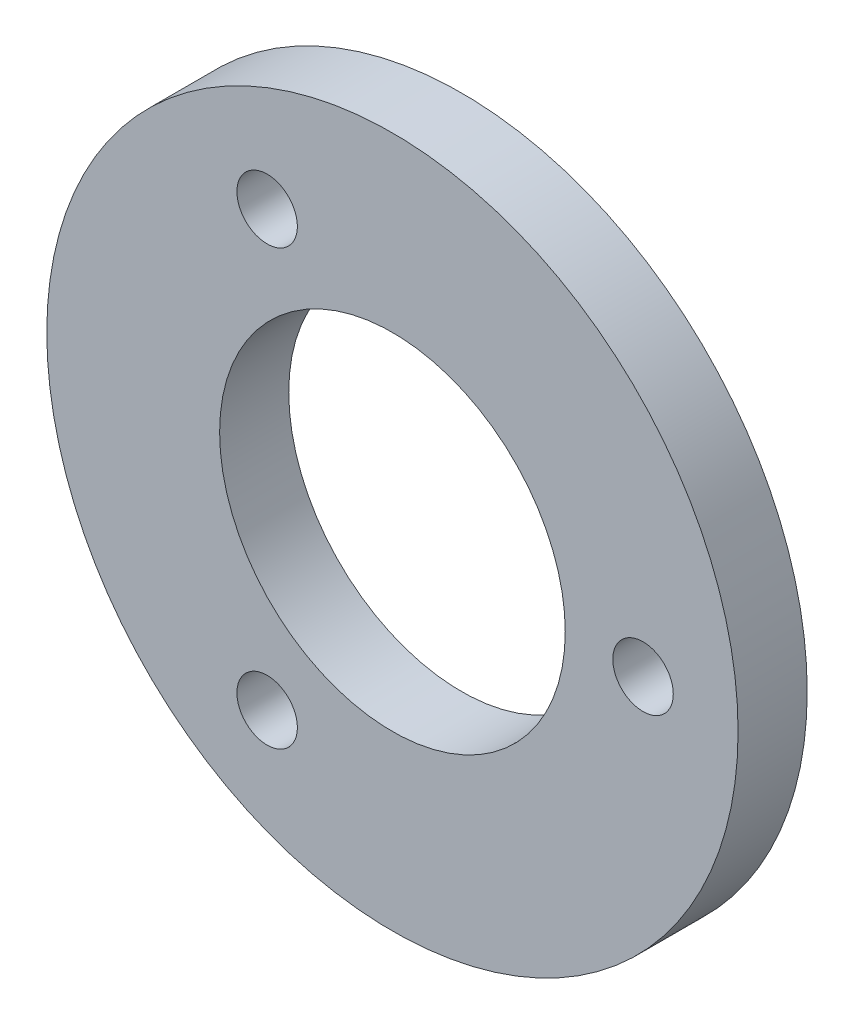
ISO-10303-21;
HEADER;
FILE_DESCRIPTION(('STEP AP214'),'2;1');
FILE_NAME('part.step','',(''),(''),'','','');
FILE_SCHEMA(('AUTOMOTIVE_DESIGN { 1 0 10303 214 1 1 1 1 }'));
ENDSEC;
DATA;
#1=APPLICATION_CONTEXT('core data for automotive mechanical design processes');
#2=APPLICATION_PROTOCOL_DEFINITION('international standard','automotive_design',2000,#1);
#3=PRODUCT_CONTEXT('',#1,'mechanical');
#4=PRODUCT('Part','Part','',(#3));
#5=PRODUCT_RELATED_PRODUCT_CATEGORY('part','',(#4));
#6=PRODUCT_DEFINITION_FORMATION('','',#4);
#7=PRODUCT_DEFINITION_CONTEXT('part definition',#1,'design');
#8=PRODUCT_DEFINITION('design','',#6,#7);
#9=PRODUCT_DEFINITION_SHAPE('','',#8);
#10=(LENGTH_UNIT() NAMED_UNIT(*) SI_UNIT(.MILLI.,.METRE.));
#11=(NAMED_UNIT(*) PLANE_ANGLE_UNIT() SI_UNIT($,.RADIAN.));
#12=(NAMED_UNIT(*) SI_UNIT($,.STERADIAN.) SOLID_ANGLE_UNIT());
#13=UNCERTAINTY_MEASURE_WITH_UNIT(LENGTH_MEASURE(1.E-05),#10,'distance_accuracy_value','');
#14=(GEOMETRIC_REPRESENTATION_CONTEXT(3) GLOBAL_UNCERTAINTY_ASSIGNED_CONTEXT((#13)) GLOBAL_UNIT_ASSIGNED_CONTEXT((#10,
#11,#12)) REPRESENTATION_CONTEXT('',''));
#15=CARTESIAN_POINT('',(0.,0.,0.));
#16=DIRECTION('',(0.,0.,1.));
#17=DIRECTION('',(1.,0.,0.));
#18=AXIS2_PLACEMENT_3D('',#15,#16,#17);
#19=CARTESIAN_POINT('',(0.,0.,4.));
#20=DIRECTION('',(0.,0.,1.));
#21=DIRECTION('',(1.,0.,0.));
#22=AXIS2_PLACEMENT_3D('',#19,#20,#21);
#23=PLANE('',#22);
#24=CARTESIAN_POINT('',(-7.25000000000006,-12.5573683548743,4.));
#25=DIRECTION('',(0.,0.,1.));
#26=DIRECTION('',(1.,0.,0.));
#27=AXIS2_PLACEMENT_3D('',#24,#25,#26);
#28=CIRCLE('',#27,1.75);
#29=CARTESIAN_POINT('',(-5.50000000000006,-12.5573683548743,4.));
#30=VERTEX_POINT('',#29);
#31=EDGE_CURVE('E52',#30,#30,#28,.T.);
#32=ORIENTED_EDGE('',*,*,#31,.F.);
#33=EDGE_LOOP('',(#32));
#34=FACE_BOUND('',#33,.T.);
#35=CARTESIAN_POINT('',(0.,0.,4.));
#36=DIRECTION('',(0.,0.,1.));
#37=DIRECTION('',(1.,0.,0.));
#38=AXIS2_PLACEMENT_3D('',#35,#36,#37);
#39=CIRCLE('',#38,10.);
#40=CARTESIAN_POINT('',(10.,0.,4.));
#41=VERTEX_POINT('',#40);
#42=EDGE_CURVE('E41',#41,#41,#39,.T.);
#43=ORIENTED_EDGE('',*,*,#42,.F.);
#44=EDGE_LOOP('',(#43));
#45=FACE_BOUND('',#44,.T.);
#46=CARTESIAN_POINT('',(0.,0.,4.));
#47=DIRECTION('',(0.,0.,1.));
#48=DIRECTION('',(1.,0.,0.));
#49=AXIS2_PLACEMENT_3D('',#46,#47,#48);
#50=CIRCLE('',#49,20.);
#51=CARTESIAN_POINT('',(20.,0.,4.));
#52=VERTEX_POINT('',#51);
#53=EDGE_CURVE('E10',#52,#52,#50,.T.);
#54=ORIENTED_EDGE('',*,*,#53,.T.);
#55=EDGE_LOOP('',(#54));
#56=FACE_BOUND('',#55,.T.);
#57=CARTESIAN_POINT('',(14.5,0.,4.));
#58=DIRECTION('',(0.,0.,1.));
#59=DIRECTION('',(1.,0.,0.));
#60=AXIS2_PLACEMENT_3D('',#57,#58,#59);
#61=CIRCLE('',#60,1.75);
#62=CARTESIAN_POINT('',(16.25,0.,4.));
#63=VERTEX_POINT('',#62);
#64=EDGE_CURVE('E46',#63,#63,#61,.T.);
#65=ORIENTED_EDGE('',*,*,#64,.F.);
#66=EDGE_LOOP('',(#65));
#67=FACE_BOUND('',#66,.T.);
#68=CARTESIAN_POINT('',(-7.24999999999988,12.5573683548744,4.));
#69=DIRECTION('',(0.,0.,1.));
#70=DIRECTION('',(1.,0.,0.));
#71=AXIS2_PLACEMENT_3D('',#68,#69,#70);
#72=CIRCLE('',#71,1.75);
#73=CARTESIAN_POINT('',(-5.49999999999988,12.5573683548744,4.));
#74=VERTEX_POINT('',#73);
#75=EDGE_CURVE('E58',#74,#74,#72,.T.);
#76=ORIENTED_EDGE('',*,*,#75,.F.);
#77=EDGE_LOOP('',(#76));
#78=FACE_BOUND('',#77,.T.);
#79=ADVANCED_FACE('F30',(#34,#45,#56,#67,#78),#23,.T.);
#80=CARTESIAN_POINT('',(0.,0.,0.));
#81=DIRECTION('',(0.,0.,1.));
#82=DIRECTION('',(1.,0.,0.));
#83=AXIS2_PLACEMENT_3D('',#80,#81,#82);
#84=PLANE('',#83);
#85=CARTESIAN_POINT('',(0.,0.,0.));
#86=DIRECTION('',(0.,0.,1.));
#87=DIRECTION('',(1.,0.,0.));
#88=AXIS2_PLACEMENT_3D('',#85,#86,#87);
#89=CIRCLE('',#88,20.);
#90=CARTESIAN_POINT('',(20.,0.,0.));
#91=VERTEX_POINT('',#90);
#92=EDGE_CURVE('E34',#91,#91,#89,.T.);
#93=ORIENTED_EDGE('',*,*,#92,.F.);
#94=EDGE_LOOP('',(#93));
#95=FACE_BOUND('',#94,.T.);
#96=CARTESIAN_POINT('',(0.,0.,0.));
#97=DIRECTION('',(0.,0.,1.));
#98=DIRECTION('',(1.,0.,0.));
#99=AXIS2_PLACEMENT_3D('',#96,#97,#98);
#100=CIRCLE('',#99,10.);
#101=CARTESIAN_POINT('',(10.,0.,0.));
#102=VERTEX_POINT('',#101);
#103=EDGE_CURVE('E43',#102,#102,#100,.T.);
#104=ORIENTED_EDGE('',*,*,#103,.T.);
#105=EDGE_LOOP('',(#104));
#106=FACE_BOUND('',#105,.T.);
#107=CARTESIAN_POINT('',(14.5,0.,0.));
#108=DIRECTION('',(0.,0.,1.));
#109=DIRECTION('',(1.,0.,0.));
#110=AXIS2_PLACEMENT_3D('',#107,#108,#109);
#111=CIRCLE('',#110,1.75);
#112=CARTESIAN_POINT('',(16.25,0.,0.));
#113=VERTEX_POINT('',#112);
#114=EDGE_CURVE('E49',#113,#113,#111,.T.);
#115=ORIENTED_EDGE('',*,*,#114,.T.);
#116=EDGE_LOOP('',(#115));
#117=FACE_BOUND('',#116,.T.);
#118=CARTESIAN_POINT('',(-7.25000000000006,-12.5573683548743,0.));
#119=DIRECTION('',(0.,0.,1.));
#120=DIRECTION('',(1.,0.,0.));
#121=AXIS2_PLACEMENT_3D('',#118,#119,#120);
#122=CIRCLE('',#121,1.75);
#123=CARTESIAN_POINT('',(-5.50000000000006,-12.5573683548743,0.));
#124=VERTEX_POINT('',#123);
#125=EDGE_CURVE('E55',#124,#124,#122,.T.);
#126=ORIENTED_EDGE('',*,*,#125,.T.);
#127=EDGE_LOOP('',(#126));
#128=FACE_BOUND('',#127,.T.);
#129=CARTESIAN_POINT('',(-7.24999999999988,12.5573683548744,0.));
#130=DIRECTION('',(0.,0.,1.));
#131=DIRECTION('',(1.,0.,0.));
#132=AXIS2_PLACEMENT_3D('',#129,#130,#131);
#133=CIRCLE('',#132,1.75);
#134=CARTESIAN_POINT('',(-5.49999999999988,12.5573683548744,0.));
#135=VERTEX_POINT('',#134);
#136=EDGE_CURVE('E61',#135,#135,#133,.T.);
#137=ORIENTED_EDGE('',*,*,#136,.T.);
#138=EDGE_LOOP('',(#137));
#139=FACE_BOUND('',#138,.T.);
#140=ADVANCED_FACE('F71',(#95,#106,#117,#128,#139),#84,.F.);
#141=CARTESIAN_POINT('',(0.,0.,4.));
#142=DIRECTION('',(0.,0.,-1.));
#143=DIRECTION('',(-1.,0.,0.));
#144=AXIS2_PLACEMENT_3D('',#141,#142,#143);
#145=CYLINDRICAL_SURFACE('',#144,20.);
#146=ORIENTED_EDGE('',*,*,#53,.F.);
#147=EDGE_LOOP('',(#146));
#148=FACE_BOUND('',#147,.T.);
#149=ORIENTED_EDGE('',*,*,#92,.T.);
#150=EDGE_LOOP('',(#149));
#151=FACE_BOUND('',#150,.T.);
#152=ADVANCED_FACE('F32',(#148,#151),#145,.T.);
#153=CARTESIAN_POINT('',(0.,0.,4.));
#154=DIRECTION('',(0.,0.,-1.));
#155=DIRECTION('',(-1.,0.,0.));
#156=AXIS2_PLACEMENT_3D('',#153,#154,#155);
#157=CYLINDRICAL_SURFACE('',#156,10.);
#158=ORIENTED_EDGE('',*,*,#42,.T.);
#159=EDGE_LOOP('',(#158));
#160=FACE_BOUND('',#159,.T.);
#161=ORIENTED_EDGE('',*,*,#103,.F.);
#162=EDGE_LOOP('',(#161));
#163=FACE_BOUND('',#162,.T.);
#164=ADVANCED_FACE('F81',(#160,#163),#157,.F.);
#165=CARTESIAN_POINT('',(14.5,0.,4.));
#166=DIRECTION('',(0.,0.,-1.));
#167=DIRECTION('',(-1.,0.,0.));
#168=AXIS2_PLACEMENT_3D('',#165,#166,#167);
#169=CYLINDRICAL_SURFACE('',#168,1.75);
#170=ORIENTED_EDGE('',*,*,#64,.T.);
#171=EDGE_LOOP('',(#170));
#172=FACE_BOUND('',#171,.T.);
#173=ORIENTED_EDGE('',*,*,#114,.F.);
#174=EDGE_LOOP('',(#173));
#175=FACE_BOUND('',#174,.T.);
#176=ADVANCED_FACE('F84',(#172,#175),#169,.F.);
#177=CARTESIAN_POINT('',(-7.25000000000006,-12.5573683548743,4.));
#178=DIRECTION('',(0.,0.,-1.));
#179=DIRECTION('',(-1.,0.,0.));
#180=AXIS2_PLACEMENT_3D('',#177,#178,#179);
#181=CYLINDRICAL_SURFACE('',#180,1.75);
#182=ORIENTED_EDGE('',*,*,#31,.T.);
#183=EDGE_LOOP('',(#182));
#184=FACE_BOUND('',#183,.T.);
#185=ORIENTED_EDGE('',*,*,#125,.F.);
#186=EDGE_LOOP('',(#185));
#187=FACE_BOUND('',#186,.T.);
#188=ADVANCED_FACE('F88',(#184,#187),#181,.F.);
#189=CARTESIAN_POINT('',(-7.24999999999988,12.5573683548744,4.));
#190=DIRECTION('',(0.,0.,-1.));
#191=DIRECTION('',(-1.,0.,0.));
#192=AXIS2_PLACEMENT_3D('',#189,#190,#191);
#193=CYLINDRICAL_SURFACE('',#192,1.75);
#194=ORIENTED_EDGE('',*,*,#75,.T.);
#195=EDGE_LOOP('',(#194));
#196=FACE_BOUND('',#195,.T.);
#197=ORIENTED_EDGE('',*,*,#136,.F.);
#198=EDGE_LOOP('',(#197));
#199=FACE_BOUND('',#198,.T.);
#200=ADVANCED_FACE('F67',(#196,#199),#193,.F.);
#201=CLOSED_SHELL('',(#79,#140,#152,#164,#176,#188,#200));
#202=MANIFOLD_SOLID_BREP('B2',#201);
#203=ADVANCED_BREP_SHAPE_REPRESENTATION('',(#18,#202),#14);
#204=SHAPE_DEFINITION_REPRESENTATION(#9,#203);
ENDSEC;
END-ISO-10303-21;
